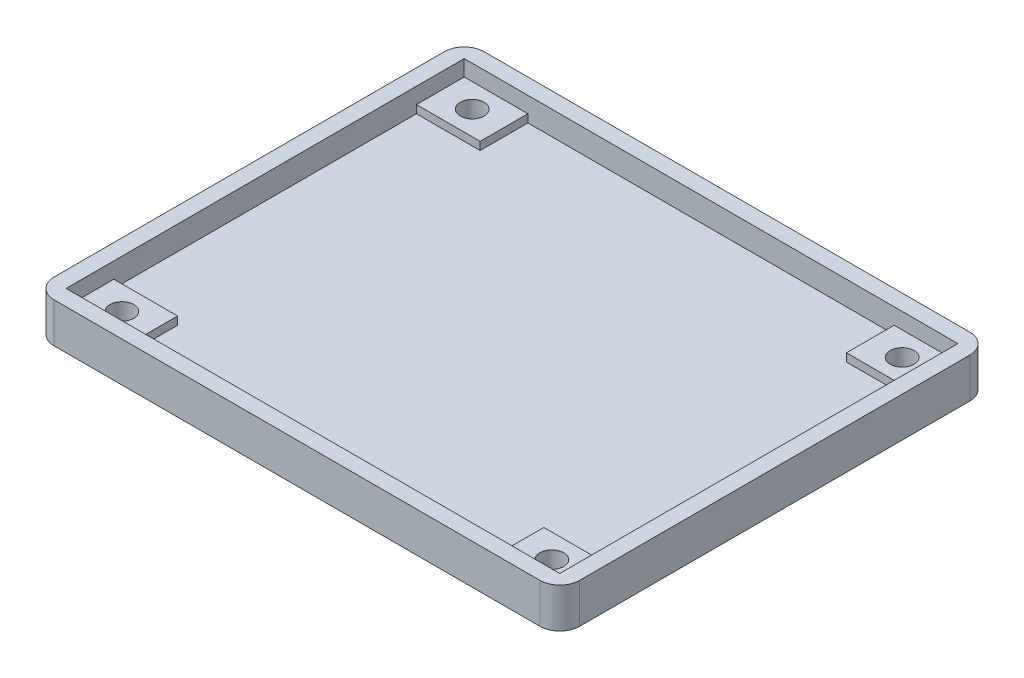
ISO-10303-21;
HEADER;
FILE_DESCRIPTION(('STEP AP214'),'2;1');
FILE_NAME('part.step','',(''),(''),'','','');
FILE_SCHEMA(('AUTOMOTIVE_DESIGN { 1 0 10303 214 1 1 1 1 }'));
ENDSEC;
DATA;
#1=APPLICATION_CONTEXT('core data for automotive mechanical design processes');
#2=APPLICATION_PROTOCOL_DEFINITION('international standard','automotive_design',2000,#1);
#3=PRODUCT_CONTEXT('',#1,'mechanical');
#4=PRODUCT('Part','Part','',(#3));
#5=PRODUCT_RELATED_PRODUCT_CATEGORY('part','',(#4));
#6=PRODUCT_DEFINITION_FORMATION('','',#4);
#7=PRODUCT_DEFINITION_CONTEXT('part definition',#1,'design');
#8=PRODUCT_DEFINITION('design','',#6,#7);
#9=PRODUCT_DEFINITION_SHAPE('','',#8);
#10=(LENGTH_UNIT() NAMED_UNIT(*) SI_UNIT(.MILLI.,.METRE.));
#11=(NAMED_UNIT(*) PLANE_ANGLE_UNIT() SI_UNIT($,.RADIAN.));
#12=(NAMED_UNIT(*) SI_UNIT($,.STERADIAN.) SOLID_ANGLE_UNIT());
#13=UNCERTAINTY_MEASURE_WITH_UNIT(LENGTH_MEASURE(1.E-05),#10,'distance_accuracy_value','');
#14=(GEOMETRIC_REPRESENTATION_CONTEXT(3) GLOBAL_UNCERTAINTY_ASSIGNED_CONTEXT((#13)) GLOBAL_UNIT_ASSIGNED_CONTEXT((#10,
#11,#12)) REPRESENTATION_CONTEXT('',''));
#15=CARTESIAN_POINT('',(0.,0.,0.));
#16=DIRECTION('',(0.,0.,1.));
#17=DIRECTION('',(1.,0.,0.));
#18=AXIS2_PLACEMENT_3D('',#15,#16,#17);
#19=CARTESIAN_POINT('',(31.,2.,25.));
#20=DIRECTION('',(1.,0.,0.));
#21=DIRECTION('',(0.,0.,-1.));
#22=AXIS2_PLACEMENT_3D('',#19,#20,#21);
#23=PLANE('',#22);
#24=DIRECTION('',(0.,1.,0.));
#25=VECTOR('',#24,1.);
#26=CARTESIAN_POINT('',(31.,2.,-25.));
#27=LINE('',#26,#25);
#28=CARTESIAN_POINT('',(31.,3.,-25.));
#29=VERTEX_POINT('',#28);
#30=CARTESIAN_POINT('',(31.,5.,-25.));
#31=VERTEX_POINT('',#30);
#32=EDGE_CURVE('E346',#29,#31,#27,.T.);
#33=ORIENTED_EDGE('',*,*,#32,.F.);
#34=DIRECTION('',(0.,0.,-1.));
#35=VECTOR('',#34,1.);
#36=CARTESIAN_POINT('',(31.,3.,-25.));
#37=LINE('',#36,#35);
#38=CARTESIAN_POINT('',(31.,3.,-19.));
#39=VERTEX_POINT('',#38);
#40=EDGE_CURVE('E229',#39,#29,#37,.T.);
#41=ORIENTED_EDGE('',*,*,#40,.F.);
#42=DIRECTION('',(0.,-1.,0.));
#43=VECTOR('',#42,1.);
#44=CARTESIAN_POINT('',(31.,3.,-19.));
#45=LINE('',#44,#43);
#46=CARTESIAN_POINT('',(31.,2.,-19.));
#47=VERTEX_POINT('',#46);
#48=EDGE_CURVE('E224',#39,#47,#45,.T.);
#49=ORIENTED_EDGE('',*,*,#48,.T.);
#50=DIRECTION('',(0.,0.,-1.));
#51=VECTOR('',#50,1.);
#52=CARTESIAN_POINT('',(31.,2.,25.));
#53=LINE('',#52,#51);
#54=CARTESIAN_POINT('',(31.,2.,19.));
#55=VERTEX_POINT('',#54);
#56=EDGE_CURVE('E333',#55,#47,#53,.T.);
#57=ORIENTED_EDGE('',*,*,#56,.F.);
#58=DIRECTION('',(0.,-1.,0.));
#59=VECTOR('',#58,1.);
#60=CARTESIAN_POINT('',(31.,3.,19.));
#61=LINE('',#60,#59);
#62=CARTESIAN_POINT('',(31.,3.,19.));
#63=VERTEX_POINT('',#62);
#64=EDGE_CURVE('E266',#63,#55,#61,.T.);
#65=ORIENTED_EDGE('',*,*,#64,.F.);
#66=DIRECTION('',(0.,0.,-1.));
#67=VECTOR('',#66,1.);
#68=CARTESIAN_POINT('',(31.,3.,25.));
#69=LINE('',#68,#67);
#70=CARTESIAN_POINT('',(31.,3.,25.));
#71=VERTEX_POINT('',#70);
#72=EDGE_CURVE('E247',#71,#63,#69,.T.);
#73=ORIENTED_EDGE('',*,*,#72,.F.);
#74=DIRECTION('',(0.,1.,0.));
#75=VECTOR('',#74,1.);
#76=CARTESIAN_POINT('',(31.,2.,25.));
#77=LINE('',#76,#75);
#78=CARTESIAN_POINT('',(31.,5.,25.));
#79=VERTEX_POINT('',#78);
#80=EDGE_CURVE('E361',#71,#79,#77,.T.);
#81=ORIENTED_EDGE('',*,*,#80,.T.);
#82=DIRECTION('',(0.,0.,-1.));
#83=VECTOR('',#82,1.);
#84=CARTESIAN_POINT('',(31.,5.,25.));
#85=LINE('',#84,#83);
#86=EDGE_CURVE('E332',#79,#31,#85,.T.);
#87=ORIENTED_EDGE('',*,*,#86,.T.);
#88=EDGE_LOOP('',(#33,#41,#49,#57,#65,#73,#81,#87));
#89=FACE_BOUND('',#88,.T.);
#90=ADVANCED_FACE('F39',(#89),#23,.F.);
#91=CARTESIAN_POINT('',(-31.,2.,25.));
#92=DIRECTION('',(0.,0.,1.));
#93=DIRECTION('',(1.,0.,0.));
#94=AXIS2_PLACEMENT_3D('',#91,#92,#93);
#95=PLANE('',#94);
#96=DIRECTION('',(1.,0.,0.));
#97=VECTOR('',#96,1.);
#98=CARTESIAN_POINT('',(31.,3.,25.));
#99=LINE('',#98,#97);
#100=CARTESIAN_POINT('',(23.,3.,25.));
#101=VERTEX_POINT('',#100);
#102=EDGE_CURVE('E243',#101,#71,#99,.T.);
#103=ORIENTED_EDGE('',*,*,#102,.F.);
#104=DIRECTION('',(0.,-1.,0.));
#105=VECTOR('',#104,1.);
#106=CARTESIAN_POINT('',(23.,3.,25.));
#107=LINE('',#106,#105);
#108=CARTESIAN_POINT('',(23.,2.,25.));
#109=VERTEX_POINT('',#108);
#110=EDGE_CURVE('E258',#101,#109,#107,.T.);
#111=ORIENTED_EDGE('',*,*,#110,.T.);
#112=DIRECTION('',(1.,0.,0.));
#113=VECTOR('',#112,1.);
#114=CARTESIAN_POINT('',(-31.,2.,25.));
#115=LINE('',#114,#113);
#116=CARTESIAN_POINT('',(-23.,2.,25.));
#117=VERTEX_POINT('',#116);
#118=EDGE_CURVE('E343',#117,#109,#115,.T.);
#119=ORIENTED_EDGE('',*,*,#118,.F.);
#120=DIRECTION('',(0.,-1.,0.));
#121=VECTOR('',#120,1.);
#122=CARTESIAN_POINT('',(-23.,3.,25.));
#123=LINE('',#122,#121);
#124=CARTESIAN_POINT('',(-23.,3.,25.));
#125=VERTEX_POINT('',#124);
#126=EDGE_CURVE('E297',#125,#117,#123,.T.);
#127=ORIENTED_EDGE('',*,*,#126,.F.);
#128=DIRECTION('',(1.,0.,0.));
#129=VECTOR('',#128,1.);
#130=CARTESIAN_POINT('',(-31.,3.,25.));
#131=LINE('',#130,#129);
#132=CARTESIAN_POINT('',(-31.,3.,25.));
#133=VERTEX_POINT('',#132);
#134=EDGE_CURVE('E274',#133,#125,#131,.T.);
#135=ORIENTED_EDGE('',*,*,#134,.F.);
#136=DIRECTION('',(0.,1.,0.));
#137=VECTOR('',#136,1.);
#138=CARTESIAN_POINT('',(-31.,2.,25.));
#139=LINE('',#138,#137);
#140=CARTESIAN_POINT('',(-31.,5.,25.));
#141=VERTEX_POINT('',#140);
#142=EDGE_CURVE('E365',#133,#141,#139,.T.);
#143=ORIENTED_EDGE('',*,*,#142,.T.);
#144=DIRECTION('',(1.,0.,0.));
#145=VECTOR('',#144,1.);
#146=CARTESIAN_POINT('',(-31.,5.,25.));
#147=LINE('',#146,#145);
#148=EDGE_CURVE('E337',#141,#79,#147,.T.);
#149=ORIENTED_EDGE('',*,*,#148,.T.);
#150=ORIENTED_EDGE('',*,*,#80,.F.);
#151=EDGE_LOOP('',(#103,#111,#119,#127,#135,#143,#149,#150));
#152=FACE_BOUND('',#151,.T.);
#153=ADVANCED_FACE('F531',(#152),#95,.F.);
#154=CARTESIAN_POINT('',(33.,5.,27.));
#155=DIRECTION('',(-1.,0.,0.));
#156=DIRECTION('',(0.,0.,1.));
#157=AXIS2_PLACEMENT_3D('',#154,#155,#156);
#158=PLANE('',#157);
#159=DIRECTION('',(0.,0.,-1.));
#160=VECTOR('',#159,1.);
#161=CARTESIAN_POINT('',(33.,5.,27.));
#162=LINE('',#161,#160);
#163=CARTESIAN_POINT('',(33.,5.,24.5));
#164=VERTEX_POINT('',#163);
#165=CARTESIAN_POINT('',(33.,5.,-24.5));
#166=VERTEX_POINT('',#165);
#167=EDGE_CURVE('E373',#164,#166,#162,.T.);
#168=ORIENTED_EDGE('',*,*,#167,.F.);
#169=DIRECTION('',(0.,-1.,0.));
#170=VECTOR('',#169,1.);
#171=CARTESIAN_POINT('',(33.,5.,24.5));
#172=LINE('',#171,#170);
#173=CARTESIAN_POINT('',(33.,0.,24.5));
#174=VERTEX_POINT('',#173);
#175=EDGE_CURVE('E450',#164,#174,#172,.T.);
#176=ORIENTED_EDGE('',*,*,#175,.T.);
#177=DIRECTION('',(0.,0.,-1.));
#178=VECTOR('',#177,1.);
#179=CARTESIAN_POINT('',(33.,0.,27.));
#180=LINE('',#179,#178);
#181=CARTESIAN_POINT('',(33.,0.,-24.5));
#182=VERTEX_POINT('',#181);
#183=EDGE_CURVE('E364',#174,#182,#180,.T.);
#184=ORIENTED_EDGE('',*,*,#183,.T.);
#185=DIRECTION('',(0.,-1.,0.));
#186=VECTOR('',#185,1.);
#187=CARTESIAN_POINT('',(33.,5.,-24.5));
#188=LINE('',#187,#186);
#189=EDGE_CURVE('E430',#182,#166,#188,.F.);
#190=ORIENTED_EDGE('',*,*,#189,.T.);
#191=EDGE_LOOP('',(#168,#176,#184,#190));
#192=FACE_BOUND('',#191,.T.);
#193=ADVANCED_FACE('F516',(#192),#158,.F.);
#194=CARTESIAN_POINT('',(-33.,5.,-27.));
#195=DIRECTION('',(0.,0.,1.));
#196=DIRECTION('',(1.,0.,0.));
#197=AXIS2_PLACEMENT_3D('',#194,#195,#196);
#198=PLANE('',#197);
#199=DIRECTION('',(-1.,0.,0.));
#200=VECTOR('',#199,1.);
#201=CARTESIAN_POINT('',(-33.,5.,-27.));
#202=LINE('',#201,#200);
#203=CARTESIAN_POINT('',(30.5,5.,-27.));
#204=VERTEX_POINT('',#203);
#205=CARTESIAN_POINT('',(-30.5,5.,-27.));
#206=VERTEX_POINT('',#205);
#207=EDGE_CURVE('E377',#204,#206,#202,.T.);
#208=ORIENTED_EDGE('',*,*,#207,.F.);
#209=DIRECTION('',(0.,-1.,0.));
#210=VECTOR('',#209,1.);
#211=CARTESIAN_POINT('',(30.5,5.,-27.));
#212=LINE('',#211,#210);
#213=CARTESIAN_POINT('',(30.5,0.,-27.));
#214=VERTEX_POINT('',#213);
#215=EDGE_CURVE('E487',#204,#214,#212,.T.);
#216=ORIENTED_EDGE('',*,*,#215,.T.);
#217=DIRECTION('',(-1.,0.,0.));
#218=VECTOR('',#217,1.);
#219=CARTESIAN_POINT('',(-33.,0.,-27.));
#220=LINE('',#219,#218);
#221=CARTESIAN_POINT('',(-30.5,0.,-27.));
#222=VERTEX_POINT('',#221);
#223=EDGE_CURVE('E392',#214,#222,#220,.T.);
#224=ORIENTED_EDGE('',*,*,#223,.T.);
#225=DIRECTION('',(0.,-1.,0.));
#226=VECTOR('',#225,1.);
#227=CARTESIAN_POINT('',(-30.5,5.,-27.));
#228=LINE('',#227,#226);
#229=EDGE_CURVE('E484',#222,#206,#228,.F.);
#230=ORIENTED_EDGE('',*,*,#229,.T.);
#231=EDGE_LOOP('',(#208,#216,#224,#230));
#232=FACE_BOUND('',#231,.T.);
#233=ADVANCED_FACE('F524',(#232),#198,.F.);
#234=CARTESIAN_POINT('',(-33.,5.,27.));
#235=DIRECTION('',(1.,0.,0.));
#236=DIRECTION('',(0.,0.,-1.));
#237=AXIS2_PLACEMENT_3D('',#234,#235,#236);
#238=PLANE('',#237);
#239=DIRECTION('',(0.,0.,1.));
#240=VECTOR('',#239,1.);
#241=CARTESIAN_POINT('',(-33.,0.,27.));
#242=LINE('',#241,#240);
#243=CARTESIAN_POINT('',(-33.,0.,-24.5));
#244=VERTEX_POINT('',#243);
#245=CARTESIAN_POINT('',(-33.,0.,24.5));
#246=VERTEX_POINT('',#245);
#247=EDGE_CURVE('E396',#244,#246,#242,.T.);
#248=ORIENTED_EDGE('',*,*,#247,.T.);
#249=DIRECTION('',(0.,-1.,0.));
#250=VECTOR('',#249,1.);
#251=CARTESIAN_POINT('',(-33.,5.,24.5));
#252=LINE('',#251,#250);
#253=CARTESIAN_POINT('',(-33.,5.,24.5));
#254=VERTEX_POINT('',#253);
#255=EDGE_CURVE('E11',#246,#254,#252,.F.);
#256=ORIENTED_EDGE('',*,*,#255,.T.);
#257=DIRECTION('',(0.,0.,1.));
#258=VECTOR('',#257,1.);
#259=CARTESIAN_POINT('',(-33.,5.,27.));
#260=LINE('',#259,#258);
#261=CARTESIAN_POINT('',(-33.,5.,-24.5));
#262=VERTEX_POINT('',#261);
#263=EDGE_CURVE('E381',#262,#254,#260,.T.);
#264=ORIENTED_EDGE('',*,*,#263,.F.);
#265=DIRECTION('',(0.,-1.,0.));
#266=VECTOR('',#265,1.);
#267=CARTESIAN_POINT('',(-33.,5.,-24.5));
#268=LINE('',#267,#266);
#269=EDGE_CURVE('E48',#262,#244,#268,.T.);
#270=ORIENTED_EDGE('',*,*,#269,.T.);
#271=EDGE_LOOP('',(#248,#256,#264,#270));
#272=FACE_BOUND('',#271,.T.);
#273=ADVANCED_FACE('F494',(#272),#238,.F.);
#274=CARTESIAN_POINT('',(-33.,5.,27.));
#275=DIRECTION('',(0.,0.,-1.));
#276=DIRECTION('',(-1.,0.,0.));
#277=AXIS2_PLACEMENT_3D('',#274,#275,#276);
#278=PLANE('',#277);
#279=DIRECTION('',(1.,0.,0.));
#280=VECTOR('',#279,1.);
#281=CARTESIAN_POINT('',(-33.,0.,27.));
#282=LINE('',#281,#280);
#283=CARTESIAN_POINT('',(-30.5,0.,27.));
#284=VERTEX_POINT('',#283);
#285=CARTESIAN_POINT('',(30.5,0.,27.));
#286=VERTEX_POINT('',#285);
#287=EDGE_CURVE('E378',#284,#286,#282,.T.);
#288=ORIENTED_EDGE('',*,*,#287,.T.);
#289=DIRECTION('',(0.,-1.,0.));
#290=VECTOR('',#289,1.);
#291=CARTESIAN_POINT('',(30.5,5.,27.));
#292=LINE('',#291,#290);
#293=CARTESIAN_POINT('',(30.5,5.,27.));
#294=VERTEX_POINT('',#293);
#295=EDGE_CURVE('E470',#286,#294,#292,.F.);
#296=ORIENTED_EDGE('',*,*,#295,.T.);
#297=DIRECTION('',(1.,0.,0.));
#298=VECTOR('',#297,1.);
#299=CARTESIAN_POINT('',(-33.,5.,27.));
#300=LINE('',#299,#298);
#301=CARTESIAN_POINT('',(-30.5,5.,27.));
#302=VERTEX_POINT('',#301);
#303=EDGE_CURVE('E384',#302,#294,#300,.T.);
#304=ORIENTED_EDGE('',*,*,#303,.F.);
#305=DIRECTION('',(0.,-1.,0.));
#306=VECTOR('',#305,1.);
#307=CARTESIAN_POINT('',(-30.5,5.,27.));
#308=LINE('',#307,#306);
#309=EDGE_CURVE('E466',#302,#284,#308,.T.);
#310=ORIENTED_EDGE('',*,*,#309,.T.);
#311=EDGE_LOOP('',(#288,#296,#304,#310));
#312=FACE_BOUND('',#311,.T.);
#313=ADVANCED_FACE('F507',(#312),#278,.F.);
#314=CARTESIAN_POINT('',(0.,5.,0.));
#315=DIRECTION('',(0.,-1.,0.));
#316=DIRECTION('',(0.,0.,-1.));
#317=AXIS2_PLACEMENT_3D('',#314,#315,#316);
#318=PLANE('',#317);
#319=DIRECTION('',(-1.,0.,0.));
#320=VECTOR('',#319,1.);
#321=CARTESIAN_POINT('',(-31.,5.,-25.));
#322=LINE('',#321,#320);
#323=CARTESIAN_POINT('',(-31.,5.,-25.));
#324=VERTEX_POINT('',#323);
#325=EDGE_CURVE('E350',#31,#324,#322,.T.);
#326=ORIENTED_EDGE('',*,*,#325,.F.);
#327=ORIENTED_EDGE('',*,*,#86,.F.);
#328=ORIENTED_EDGE('',*,*,#148,.F.);
#329=DIRECTION('',(0.,0.,1.));
#330=VECTOR('',#329,1.);
#331=CARTESIAN_POINT('',(-31.,5.,25.));
#332=LINE('',#331,#330);
#333=EDGE_CURVE('E354',#324,#141,#332,.T.);
#334=ORIENTED_EDGE('',*,*,#333,.F.);
#335=EDGE_LOOP('',(#326,#327,#328,#334));
#336=FACE_BOUND('',#335,.T.);
#337=ORIENTED_EDGE('',*,*,#303,.T.);
#338=CARTESIAN_POINT('',(30.5,5.,24.5));
#339=DIRECTION('',(0.,-1.,0.));
#340=DIRECTION('',(0.,0.,-1.));
#341=AXIS2_PLACEMENT_3D('',#338,#339,#340);
#342=CIRCLE('',#341,2.5);
#343=EDGE_CURVE('E481',#294,#164,#342,.F.);
#344=ORIENTED_EDGE('',*,*,#343,.T.);
#345=ORIENTED_EDGE('',*,*,#167,.T.);
#346=CARTESIAN_POINT('',(30.5,5.,-24.5));
#347=DIRECTION('',(0.,-1.,0.));
#348=DIRECTION('',(0.,0.,-1.));
#349=AXIS2_PLACEMENT_3D('',#346,#347,#348);
#350=CIRCLE('',#349,2.5);
#351=EDGE_CURVE('E478',#166,#204,#350,.F.);
#352=ORIENTED_EDGE('',*,*,#351,.T.);
#353=ORIENTED_EDGE('',*,*,#207,.T.);
#354=CARTESIAN_POINT('',(-30.5,5.,-24.5));
#355=DIRECTION('',(0.,-1.,0.));
#356=DIRECTION('',(0.,0.,-1.));
#357=AXIS2_PLACEMENT_3D('',#354,#355,#356);
#358=CIRCLE('',#357,2.5);
#359=EDGE_CURVE('E60',#206,#262,#358,.F.);
#360=ORIENTED_EDGE('',*,*,#359,.T.);
#361=ORIENTED_EDGE('',*,*,#263,.T.);
#362=CARTESIAN_POINT('',(-30.5,5.,24.5));
#363=DIRECTION('',(0.,-1.,0.));
#364=DIRECTION('',(0.,0.,-1.));
#365=AXIS2_PLACEMENT_3D('',#362,#363,#364);
#366=CIRCLE('',#365,2.5);
#367=EDGE_CURVE('E475',#254,#302,#366,.F.);
#368=ORIENTED_EDGE('',*,*,#367,.T.);
#369=EDGE_LOOP('',(#337,#344,#345,#352,#353,#360,#361,#368));
#370=FACE_BOUND('',#369,.T.);
#371=ADVANCED_FACE('F510',(#336,#370),#318,.F.);
#372=CARTESIAN_POINT('',(0.,0.,0.));
#373=DIRECTION('',(0.,-1.,0.));
#374=DIRECTION('',(0.,0.,-1.));
#375=AXIS2_PLACEMENT_3D('',#372,#373,#374);
#376=PLANE('',#375);
#377=CARTESIAN_POINT('',(27.,0.,-22.));
#378=DIRECTION('',(0.,-1.,0.));
#379=DIRECTION('',(0.,0.,-1.));
#380=AXIS2_PLACEMENT_3D('',#377,#378,#379);
#381=CIRCLE('',#380,1.5);
#382=CARTESIAN_POINT('',(27.,0.,-23.5));
#383=VERTEX_POINT('',#382);
#384=EDGE_CURVE('E443',#383,#383,#381,.T.);
#385=ORIENTED_EDGE('',*,*,#384,.F.);
#386=EDGE_LOOP('',(#385));
#387=FACE_BOUND('',#386,.T.);
#388=CARTESIAN_POINT('',(27.,0.,22.));
#389=DIRECTION('',(0.,-1.,0.));
#390=DIRECTION('',(0.,0.,-1.));
#391=AXIS2_PLACEMENT_3D('',#388,#389,#390);
#392=CIRCLE('',#391,1.5);
#393=CARTESIAN_POINT('',(27.,0.,20.5));
#394=VERTEX_POINT('',#393);
#395=EDGE_CURVE('E439',#394,#394,#392,.T.);
#396=ORIENTED_EDGE('',*,*,#395,.F.);
#397=EDGE_LOOP('',(#396));
#398=FACE_BOUND('',#397,.T.);
#399=CARTESIAN_POINT('',(-27.,0.,22.));
#400=DIRECTION('',(0.,-1.,0.));
#401=DIRECTION('',(0.,0.,-1.));
#402=AXIS2_PLACEMENT_3D('',#399,#400,#401);
#403=CIRCLE('',#402,1.5);
#404=CARTESIAN_POINT('',(-27.,0.,20.5));
#405=VERTEX_POINT('',#404);
#406=EDGE_CURVE('E435',#405,#405,#403,.T.);
#407=ORIENTED_EDGE('',*,*,#406,.F.);
#408=EDGE_LOOP('',(#407));
#409=FACE_BOUND('',#408,.T.);
#410=CARTESIAN_POINT('',(-27.,0.,-22.));
#411=DIRECTION('',(0.,-1.,0.));
#412=DIRECTION('',(0.,0.,-1.));
#413=AXIS2_PLACEMENT_3D('',#410,#411,#412);
#414=CIRCLE('',#413,1.5);
#415=CARTESIAN_POINT('',(-27.,0.,-23.5));
#416=VERTEX_POINT('',#415);
#417=EDGE_CURVE('E431',#416,#416,#414,.T.);
#418=ORIENTED_EDGE('',*,*,#417,.F.);
#419=EDGE_LOOP('',(#418));
#420=FACE_BOUND('',#419,.T.);
#421=ORIENTED_EDGE('',*,*,#183,.F.);
#422=CARTESIAN_POINT('',(30.5,0.,24.5));
#423=DIRECTION('',(0.,-1.,0.));
#424=DIRECTION('',(0.,0.,-1.));
#425=AXIS2_PLACEMENT_3D('',#422,#423,#424);
#426=CIRCLE('',#425,2.5);
#427=EDGE_CURVE('E463',#174,#286,#426,.T.);
#428=ORIENTED_EDGE('',*,*,#427,.T.);
#429=ORIENTED_EDGE('',*,*,#287,.F.);
#430=CARTESIAN_POINT('',(-30.5,0.,24.5));
#431=DIRECTION('',(0.,-1.,0.));
#432=DIRECTION('',(0.,0.,-1.));
#433=AXIS2_PLACEMENT_3D('',#430,#431,#432);
#434=CIRCLE('',#433,2.5);
#435=EDGE_CURVE('E457',#284,#246,#434,.T.);
#436=ORIENTED_EDGE('',*,*,#435,.T.);
#437=ORIENTED_EDGE('',*,*,#247,.F.);
#438=CARTESIAN_POINT('',(-30.5,0.,-24.5));
#439=DIRECTION('',(0.,-1.,0.));
#440=DIRECTION('',(0.,0.,-1.));
#441=AXIS2_PLACEMENT_3D('',#438,#439,#440);
#442=CIRCLE('',#441,2.5);
#443=EDGE_CURVE('E454',#244,#222,#442,.T.);
#444=ORIENTED_EDGE('',*,*,#443,.T.);
#445=ORIENTED_EDGE('',*,*,#223,.F.);
#446=CARTESIAN_POINT('',(30.5,0.,-24.5));
#447=DIRECTION('',(0.,-1.,0.));
#448=DIRECTION('',(0.,0.,-1.));
#449=AXIS2_PLACEMENT_3D('',#446,#447,#448);
#450=CIRCLE('',#449,2.5);
#451=EDGE_CURVE('E460',#214,#182,#450,.T.);
#452=ORIENTED_EDGE('',*,*,#451,.T.);
#453=EDGE_LOOP('',(#421,#428,#429,#436,#437,#444,#445,#452));
#454=FACE_BOUND('',#453,.T.);
#455=ADVANCED_FACE('F498',(#387,#398,#409,#420,#454),#376,.T.);
#456=CARTESIAN_POINT('',(-31.,2.,25.));
#457=DIRECTION('',(-1.,0.,0.));
#458=DIRECTION('',(0.,0.,1.));
#459=AXIS2_PLACEMENT_3D('',#456,#457,#458);
#460=PLANE('',#459);
#461=ORIENTED_EDGE('',*,*,#142,.F.);
#462=DIRECTION('',(0.,0.,1.));
#463=VECTOR('',#462,1.);
#464=CARTESIAN_POINT('',(-31.,3.,25.));
#465=LINE('',#464,#463);
#466=CARTESIAN_POINT('',(-31.,3.,19.));
#467=VERTEX_POINT('',#466);
#468=EDGE_CURVE('E285',#467,#133,#465,.T.);
#469=ORIENTED_EDGE('',*,*,#468,.F.);
#470=DIRECTION('',(0.,-1.,0.));
#471=VECTOR('',#470,1.);
#472=CARTESIAN_POINT('',(-31.,3.,19.));
#473=LINE('',#472,#471);
#474=CARTESIAN_POINT('',(-31.,2.,19.));
#475=VERTEX_POINT('',#474);
#476=EDGE_CURVE('E289',#467,#475,#473,.T.);
#477=ORIENTED_EDGE('',*,*,#476,.T.);
#478=DIRECTION('',(0.,0.,1.));
#479=VECTOR('',#478,1.);
#480=CARTESIAN_POINT('',(-31.,2.,25.));
#481=LINE('',#480,#479);
#482=CARTESIAN_POINT('',(-31.,2.,-19.));
#483=VERTEX_POINT('',#482);
#484=EDGE_CURVE('E340',#483,#475,#481,.T.);
#485=ORIENTED_EDGE('',*,*,#484,.F.);
#486=DIRECTION('',(0.,-1.,0.));
#487=VECTOR('',#486,1.);
#488=CARTESIAN_POINT('',(-31.,3.,-19.));
#489=LINE('',#488,#487);
#490=CARTESIAN_POINT('',(-31.,3.,-19.));
#491=VERTEX_POINT('',#490);
#492=EDGE_CURVE('E328',#491,#483,#489,.T.);
#493=ORIENTED_EDGE('',*,*,#492,.F.);
#494=DIRECTION('',(0.,0.,1.));
#495=VECTOR('',#494,1.);
#496=CARTESIAN_POINT('',(-31.,3.,-25.));
#497=LINE('',#496,#495);
#498=CARTESIAN_POINT('',(-31.,3.,-25.));
#499=VERTEX_POINT('',#498);
#500=EDGE_CURVE('E305',#499,#491,#497,.T.);
#501=ORIENTED_EDGE('',*,*,#500,.F.);
#502=DIRECTION('',(0.,1.,0.));
#503=VECTOR('',#502,1.);
#504=CARTESIAN_POINT('',(-31.,2.,-25.));
#505=LINE('',#504,#503);
#506=EDGE_CURVE('E368',#499,#324,#505,.T.);
#507=ORIENTED_EDGE('',*,*,#506,.T.);
#508=ORIENTED_EDGE('',*,*,#333,.T.);
#509=EDGE_LOOP('',(#461,#469,#477,#485,#493,#501,#507,#508));
#510=FACE_BOUND('',#509,.T.);
#511=ADVANCED_FACE('F549',(#510),#460,.F.);
#512=CARTESIAN_POINT('',(-31.,2.,-25.));
#513=DIRECTION('',(0.,0.,-1.));
#514=DIRECTION('',(-1.,0.,0.));
#515=AXIS2_PLACEMENT_3D('',#512,#513,#514);
#516=PLANE('',#515);
#517=DIRECTION('',(0.,-1.,0.));
#518=VECTOR('',#517,1.);
#519=CARTESIAN_POINT('',(23.,3.,-25.));
#520=LINE('',#519,#518);
#521=CARTESIAN_POINT('',(23.,3.,-25.));
#522=VERTEX_POINT('',#521);
#523=CARTESIAN_POINT('',(23.,2.,-25.));
#524=VERTEX_POINT('',#523);
#525=EDGE_CURVE('E223',#522,#524,#520,.T.);
#526=ORIENTED_EDGE('',*,*,#525,.F.);
#527=DIRECTION('',(-1.,0.,0.));
#528=VECTOR('',#527,1.);
#529=CARTESIAN_POINT('',(31.,3.,-25.));
#530=LINE('',#529,#528);
#531=EDGE_CURVE('E210',#29,#522,#530,.T.);
#532=ORIENTED_EDGE('',*,*,#531,.F.);
#533=ORIENTED_EDGE('',*,*,#32,.T.);
#534=ORIENTED_EDGE('',*,*,#325,.T.);
#535=ORIENTED_EDGE('',*,*,#506,.F.);
#536=DIRECTION('',(-1.,0.,0.));
#537=VECTOR('',#536,1.);
#538=CARTESIAN_POINT('',(-31.,3.,-25.));
#539=LINE('',#538,#537);
#540=CARTESIAN_POINT('',(-23.,3.,-25.));
#541=VERTEX_POINT('',#540);
#542=EDGE_CURVE('E316',#541,#499,#539,.T.);
#543=ORIENTED_EDGE('',*,*,#542,.F.);
#544=DIRECTION('',(0.,-1.,0.));
#545=VECTOR('',#544,1.);
#546=CARTESIAN_POINT('',(-23.,3.,-25.));
#547=LINE('',#546,#545);
#548=CARTESIAN_POINT('',(-23.,2.,-25.));
#549=VERTEX_POINT('',#548);
#550=EDGE_CURVE('E320',#541,#549,#547,.T.);
#551=ORIENTED_EDGE('',*,*,#550,.T.);
#552=DIRECTION('',(-1.,0.,0.));
#553=VECTOR('',#552,1.);
#554=CARTESIAN_POINT('',(-31.,2.,-25.));
#555=LINE('',#554,#553);
#556=EDGE_CURVE('E336',#524,#549,#555,.T.);
#557=ORIENTED_EDGE('',*,*,#556,.F.);
#558=EDGE_LOOP('',(#526,#532,#533,#534,#535,#543,#551,#557));
#559=FACE_BOUND('',#558,.T.);
#560=ADVANCED_FACE('F542',(#559),#516,.F.);
#561=CARTESIAN_POINT('',(0.,2.,0.));
#562=DIRECTION('',(0.,-1.,0.));
#563=DIRECTION('',(0.,0.,-1.));
#564=AXIS2_PLACEMENT_3D('',#561,#562,#563);
#565=PLANE('',#564);
#566=DIRECTION('',(0.,0.,1.));
#567=VECTOR('',#566,1.);
#568=CARTESIAN_POINT('',(23.,2.,0.));
#569=LINE('',#568,#567);
#570=CARTESIAN_POINT('',(23.,2.,-19.));
#571=VERTEX_POINT('',#570);
#572=EDGE_CURVE('E219',#524,#571,#569,.T.);
#573=ORIENTED_EDGE('',*,*,#572,.F.);
#574=ORIENTED_EDGE('',*,*,#556,.T.);
#575=DIRECTION('',(0.,0.,-1.));
#576=VECTOR('',#575,1.);
#577=CARTESIAN_POINT('',(-23.,2.,0.));
#578=LINE('',#577,#576);
#579=CARTESIAN_POINT('',(-23.,2.,-19.));
#580=VERTEX_POINT('',#579);
#581=EDGE_CURVE('E388',#580,#549,#578,.T.);
#582=ORIENTED_EDGE('',*,*,#581,.F.);
#583=DIRECTION('',(1.,0.,0.));
#584=VECTOR('',#583,1.);
#585=CARTESIAN_POINT('',(0.,2.,-19.));
#586=LINE('',#585,#584);
#587=EDGE_CURVE('E405',#483,#580,#586,.T.);
#588=ORIENTED_EDGE('',*,*,#587,.F.);
#589=ORIENTED_EDGE('',*,*,#484,.T.);
#590=DIRECTION('',(-1.,0.,0.));
#591=VECTOR('',#590,1.);
#592=CARTESIAN_POINT('',(0.,2.,19.));
#593=LINE('',#592,#591);
#594=CARTESIAN_POINT('',(-23.,2.,19.));
#595=VERTEX_POINT('',#594);
#596=EDGE_CURVE('E409',#595,#475,#593,.T.);
#597=ORIENTED_EDGE('',*,*,#596,.F.);
#598=DIRECTION('',(0.,0.,-1.));
#599=VECTOR('',#598,1.);
#600=CARTESIAN_POINT('',(-23.,2.,0.));
#601=LINE('',#600,#599);
#602=EDGE_CURVE('E413',#117,#595,#601,.T.);
#603=ORIENTED_EDGE('',*,*,#602,.F.);
#604=ORIENTED_EDGE('',*,*,#118,.T.);
#605=DIRECTION('',(0.,0.,1.));
#606=VECTOR('',#605,1.);
#607=CARTESIAN_POINT('',(23.,2.,0.));
#608=LINE('',#607,#606);
#609=CARTESIAN_POINT('',(23.,2.,19.));
#610=VERTEX_POINT('',#609);
#611=EDGE_CURVE('E417',#610,#109,#608,.T.);
#612=ORIENTED_EDGE('',*,*,#611,.F.);
#613=DIRECTION('',(-1.,0.,0.));
#614=VECTOR('',#613,1.);
#615=CARTESIAN_POINT('',(0.,2.,19.));
#616=LINE('',#615,#614);
#617=EDGE_CURVE('E421',#55,#610,#616,.T.);
#618=ORIENTED_EDGE('',*,*,#617,.F.);
#619=ORIENTED_EDGE('',*,*,#56,.T.);
#620=DIRECTION('',(1.,0.,0.));
#621=VECTOR('',#620,1.);
#622=CARTESIAN_POINT('',(0.,2.,-19.));
#623=LINE('',#622,#621);
#624=EDGE_CURVE('E425',#571,#47,#623,.T.);
#625=ORIENTED_EDGE('',*,*,#624,.F.);
#626=EDGE_LOOP('',(#573,#574,#582,#588,#589,#597,#603,#604,#612,#618,#619,#625));
#627=FACE_BOUND('',#626,.T.);
#628=ADVANCED_FACE('F744',(#627),#565,.F.);
#629=CARTESIAN_POINT('',(-31.,3.,-19.));
#630=DIRECTION('',(0.,0.,-1.));
#631=DIRECTION('',(-1.,0.,0.));
#632=AXIS2_PLACEMENT_3D('',#629,#630,#631);
#633=PLANE('',#632);
#634=ORIENTED_EDGE('',*,*,#492,.T.);
#635=ORIENTED_EDGE('',*,*,#587,.T.);
#636=DIRECTION('',(0.,-1.,0.));
#637=VECTOR('',#636,1.);
#638=CARTESIAN_POINT('',(-23.,3.,-19.));
#639=LINE('',#638,#637);
#640=CARTESIAN_POINT('',(-23.,3.,-19.));
#641=VERTEX_POINT('',#640);
#642=EDGE_CURVE('E324',#641,#580,#639,.T.);
#643=ORIENTED_EDGE('',*,*,#642,.F.);
#644=DIRECTION('',(1.,0.,0.));
#645=VECTOR('',#644,1.);
#646=CARTESIAN_POINT('',(-31.,3.,-19.));
#647=LINE('',#646,#645);
#648=EDGE_CURVE('E309',#491,#641,#647,.T.);
#649=ORIENTED_EDGE('',*,*,#648,.F.);
#650=EDGE_LOOP('',(#634,#635,#643,#649));
#651=FACE_BOUND('',#650,.T.);
#652=ADVANCED_FACE('F734',(#651),#633,.F.);
#653=CARTESIAN_POINT('',(-23.,3.,-25.));
#654=DIRECTION('',(-1.,0.,0.));
#655=DIRECTION('',(0.,0.,1.));
#656=AXIS2_PLACEMENT_3D('',#653,#654,#655);
#657=PLANE('',#656);
#658=ORIENTED_EDGE('',*,*,#642,.T.);
#659=ORIENTED_EDGE('',*,*,#581,.T.);
#660=ORIENTED_EDGE('',*,*,#550,.F.);
#661=DIRECTION('',(0.,0.,-1.));
#662=VECTOR('',#661,1.);
#663=CARTESIAN_POINT('',(-23.,3.,-25.));
#664=LINE('',#663,#662);
#665=EDGE_CURVE('E312',#641,#541,#664,.T.);
#666=ORIENTED_EDGE('',*,*,#665,.F.);
#667=EDGE_LOOP('',(#658,#659,#660,#666));
#668=FACE_BOUND('',#667,.T.);
#669=ADVANCED_FACE('F641',(#668),#657,.F.);
#670=CARTESIAN_POINT('',(-27.,3.,-22.));
#671=DIRECTION('',(0.,-1.,0.));
#672=DIRECTION('',(0.,0.,-1.));
#673=AXIS2_PLACEMENT_3D('',#670,#671,#672);
#674=CYLINDRICAL_SURFACE('',#673,1.5);
#675=CARTESIAN_POINT('',(-27.,3.,-22.));
#676=DIRECTION('',(0.,1.,0.));
#677=DIRECTION('',(0.,0.,1.));
#678=AXIS2_PLACEMENT_3D('',#675,#676,#677);
#679=CIRCLE('',#678,1.5);
#680=CARTESIAN_POINT('',(-27.,3.,-20.5));
#681=VERTEX_POINT('',#680);
#682=EDGE_CURVE('E301',#681,#681,#679,.T.);
#683=ORIENTED_EDGE('',*,*,#682,.T.);
#684=EDGE_LOOP('',(#683));
#685=FACE_BOUND('',#684,.T.);
#686=ORIENTED_EDGE('',*,*,#417,.T.);
#687=EDGE_LOOP('',(#686));
#688=FACE_BOUND('',#687,.T.);
#689=ADVANCED_FACE('F635',(#685,#688),#674,.F.);
#690=CARTESIAN_POINT('',(0.,3.,0.));
#691=DIRECTION('',(0.,1.,0.));
#692=DIRECTION('',(0.,0.,1.));
#693=AXIS2_PLACEMENT_3D('',#690,#691,#692);
#694=PLANE('',#693);
#695=ORIENTED_EDGE('',*,*,#500,.T.);
#696=ORIENTED_EDGE('',*,*,#648,.T.);
#697=ORIENTED_EDGE('',*,*,#665,.T.);
#698=ORIENTED_EDGE('',*,*,#542,.T.);
#699=EDGE_LOOP('',(#695,#696,#697,#698));
#700=FACE_BOUND('',#699,.T.);
#701=ORIENTED_EDGE('',*,*,#682,.F.);
#702=EDGE_LOOP('',(#701));
#703=FACE_BOUND('',#702,.T.);
#704=ADVANCED_FACE('F640',(#700,#703),#694,.T.);
#705=CARTESIAN_POINT('',(-23.,3.,25.));
#706=DIRECTION('',(-1.,0.,0.));
#707=DIRECTION('',(0.,0.,1.));
#708=AXIS2_PLACEMENT_3D('',#705,#706,#707);
#709=PLANE('',#708);
#710=ORIENTED_EDGE('',*,*,#126,.T.);
#711=ORIENTED_EDGE('',*,*,#602,.T.);
#712=DIRECTION('',(0.,-1.,0.));
#713=VECTOR('',#712,1.);
#714=CARTESIAN_POINT('',(-23.,3.,19.));
#715=LINE('',#714,#713);
#716=CARTESIAN_POINT('',(-23.,3.,19.));
#717=VERTEX_POINT('',#716);
#718=EDGE_CURVE('E293',#717,#595,#715,.T.);
#719=ORIENTED_EDGE('',*,*,#718,.F.);
#720=DIRECTION('',(0.,0.,-1.));
#721=VECTOR('',#720,1.);
#722=CARTESIAN_POINT('',(-23.,3.,25.));
#723=LINE('',#722,#721);
#724=EDGE_CURVE('E278',#125,#717,#723,.T.);
#725=ORIENTED_EDGE('',*,*,#724,.F.);
#726=EDGE_LOOP('',(#710,#711,#719,#725));
#727=FACE_BOUND('',#726,.T.);
#728=ADVANCED_FACE('F708',(#727),#709,.F.);
#729=CARTESIAN_POINT('',(-31.,3.,19.));
#730=DIRECTION('',(0.,0.,1.));
#731=DIRECTION('',(1.,0.,0.));
#732=AXIS2_PLACEMENT_3D('',#729,#730,#731);
#733=PLANE('',#732);
#734=ORIENTED_EDGE('',*,*,#718,.T.);
#735=ORIENTED_EDGE('',*,*,#596,.T.);
#736=ORIENTED_EDGE('',*,*,#476,.F.);
#737=DIRECTION('',(-1.,0.,0.));
#738=VECTOR('',#737,1.);
#739=CARTESIAN_POINT('',(-31.,3.,19.));
#740=LINE('',#739,#738);
#741=EDGE_CURVE('E281',#717,#467,#740,.T.);
#742=ORIENTED_EDGE('',*,*,#741,.F.);
#743=EDGE_LOOP('',(#734,#735,#736,#742));
#744=FACE_BOUND('',#743,.T.);
#745=ADVANCED_FACE('F626',(#744),#733,.F.);
#746=CARTESIAN_POINT('',(-27.,3.,22.));
#747=DIRECTION('',(0.,-1.,0.));
#748=DIRECTION('',(0.,0.,-1.));
#749=AXIS2_PLACEMENT_3D('',#746,#747,#748);
#750=CYLINDRICAL_SURFACE('',#749,1.5);
#751=CARTESIAN_POINT('',(-27.,3.,22.));
#752=DIRECTION('',(0.,1.,0.));
#753=DIRECTION('',(0.,0.,-1.));
#754=AXIS2_PLACEMENT_3D('',#751,#752,#753);
#755=CIRCLE('',#754,1.5);
#756=CARTESIAN_POINT('',(-27.,3.,20.5));
#757=VERTEX_POINT('',#756);
#758=EDGE_CURVE('E270',#757,#757,#755,.T.);
#759=ORIENTED_EDGE('',*,*,#758,.T.);
#760=EDGE_LOOP('',(#759));
#761=FACE_BOUND('',#760,.T.);
#762=ORIENTED_EDGE('',*,*,#406,.T.);
#763=EDGE_LOOP('',(#762));
#764=FACE_BOUND('',#763,.T.);
#765=ADVANCED_FACE('F619',(#761,#764),#750,.F.);
#766=CARTESIAN_POINT('',(0.,3.,0.));
#767=DIRECTION('',(0.,1.,0.));
#768=DIRECTION('',(0.,0.,1.));
#769=AXIS2_PLACEMENT_3D('',#766,#767,#768);
#770=PLANE('',#769);
#771=ORIENTED_EDGE('',*,*,#134,.T.);
#772=ORIENTED_EDGE('',*,*,#724,.T.);
#773=ORIENTED_EDGE('',*,*,#741,.T.);
#774=ORIENTED_EDGE('',*,*,#468,.T.);
#775=EDGE_LOOP('',(#771,#772,#773,#774));
#776=FACE_BOUND('',#775,.T.);
#777=ORIENTED_EDGE('',*,*,#758,.F.);
#778=EDGE_LOOP('',(#777));
#779=FACE_BOUND('',#778,.T.);
#780=ADVANCED_FACE('F625',(#776,#779),#770,.T.);
#781=CARTESIAN_POINT('',(31.,3.,19.));
#782=DIRECTION('',(0.,0.,1.));
#783=DIRECTION('',(1.,0.,0.));
#784=AXIS2_PLACEMENT_3D('',#781,#782,#783);
#785=PLANE('',#784);
#786=ORIENTED_EDGE('',*,*,#64,.T.);
#787=ORIENTED_EDGE('',*,*,#617,.T.);
#788=DIRECTION('',(0.,-1.,0.));
#789=VECTOR('',#788,1.);
#790=CARTESIAN_POINT('',(23.,3.,19.));
#791=LINE('',#790,#789);
#792=CARTESIAN_POINT('',(23.,3.,19.));
#793=VERTEX_POINT('',#792);
#794=EDGE_CURVE('E262',#793,#610,#791,.T.);
#795=ORIENTED_EDGE('',*,*,#794,.F.);
#796=DIRECTION('',(-1.,0.,0.));
#797=VECTOR('',#796,1.);
#798=CARTESIAN_POINT('',(31.,3.,19.));
#799=LINE('',#798,#797);
#800=EDGE_CURVE('E251',#63,#793,#799,.T.);
#801=ORIENTED_EDGE('',*,*,#800,.F.);
#802=EDGE_LOOP('',(#786,#787,#795,#801));
#803=FACE_BOUND('',#802,.T.);
#804=ADVANCED_FACE('F682',(#803),#785,.F.);
#805=CARTESIAN_POINT('',(23.,3.,25.));
#806=DIRECTION('',(1.,0.,0.));
#807=DIRECTION('',(0.,0.,-1.));
#808=AXIS2_PLACEMENT_3D('',#805,#806,#807);
#809=PLANE('',#808);
#810=ORIENTED_EDGE('',*,*,#794,.T.);
#811=ORIENTED_EDGE('',*,*,#611,.T.);
#812=ORIENTED_EDGE('',*,*,#110,.F.);
#813=DIRECTION('',(0.,0.,1.));
#814=VECTOR('',#813,1.);
#815=CARTESIAN_POINT('',(23.,3.,25.));
#816=LINE('',#815,#814);
#817=EDGE_CURVE('E254',#793,#101,#816,.T.);
#818=ORIENTED_EDGE('',*,*,#817,.F.);
#819=EDGE_LOOP('',(#810,#811,#812,#818));
#820=FACE_BOUND('',#819,.T.);
#821=ADVANCED_FACE('F610',(#820),#809,.F.);
#822=CARTESIAN_POINT('',(27.,3.,22.));
#823=DIRECTION('',(0.,-1.,0.));
#824=DIRECTION('',(0.,0.,-1.));
#825=AXIS2_PLACEMENT_3D('',#822,#823,#824);
#826=CYLINDRICAL_SURFACE('',#825,1.5);
#827=CARTESIAN_POINT('',(27.,3.,22.));
#828=DIRECTION('',(0.,1.,0.));
#829=DIRECTION('',(0.,0.,1.));
#830=AXIS2_PLACEMENT_3D('',#827,#828,#829);
#831=CIRCLE('',#830,1.5);
#832=CARTESIAN_POINT('',(27.,3.,23.5));
#833=VERTEX_POINT('',#832);
#834=EDGE_CURVE('E239',#833,#833,#831,.T.);
#835=ORIENTED_EDGE('',*,*,#834,.T.);
#836=EDGE_LOOP('',(#835));
#837=FACE_BOUND('',#836,.T.);
#838=ORIENTED_EDGE('',*,*,#395,.T.);
#839=EDGE_LOOP('',(#838));
#840=FACE_BOUND('',#839,.T.);
#841=ADVANCED_FACE('F603',(#837,#840),#826,.F.);
#842=CARTESIAN_POINT('',(0.,3.,0.));
#843=DIRECTION('',(0.,-1.,0.));
#844=DIRECTION('',(0.,0.,-1.));
#845=AXIS2_PLACEMENT_3D('',#842,#843,#844);
#846=PLANE('',#845);
#847=ORIENTED_EDGE('',*,*,#102,.T.);
#848=ORIENTED_EDGE('',*,*,#72,.T.);
#849=ORIENTED_EDGE('',*,*,#800,.T.);
#850=ORIENTED_EDGE('',*,*,#817,.T.);
#851=EDGE_LOOP('',(#847,#848,#849,#850));
#852=FACE_BOUND('',#851,.T.);
#853=ORIENTED_EDGE('',*,*,#834,.F.);
#854=EDGE_LOOP('',(#853));
#855=FACE_BOUND('',#854,.T.);
#856=ADVANCED_FACE('F609',(#852,#855),#846,.F.);
#857=CARTESIAN_POINT('',(23.,3.,-25.));
#858=DIRECTION('',(1.,0.,0.));
#859=DIRECTION('',(0.,0.,-1.));
#860=AXIS2_PLACEMENT_3D('',#857,#858,#859);
#861=PLANE('',#860);
#862=ORIENTED_EDGE('',*,*,#525,.T.);
#863=ORIENTED_EDGE('',*,*,#572,.T.);
#864=DIRECTION('',(0.,-1.,0.));
#865=VECTOR('',#864,1.);
#866=CARTESIAN_POINT('',(23.,3.,-19.));
#867=LINE('',#866,#865);
#868=CARTESIAN_POINT('',(23.,3.,-19.));
#869=VERTEX_POINT('',#868);
#870=EDGE_CURVE('E217',#869,#571,#867,.T.);
#871=ORIENTED_EDGE('',*,*,#870,.F.);
#872=DIRECTION('',(0.,0.,1.));
#873=VECTOR('',#872,1.);
#874=CARTESIAN_POINT('',(23.,3.,-25.));
#875=LINE('',#874,#873);
#876=EDGE_CURVE('E202',#522,#869,#875,.T.);
#877=ORIENTED_EDGE('',*,*,#876,.F.);
#878=EDGE_LOOP('',(#862,#863,#871,#877));
#879=FACE_BOUND('',#878,.T.);
#880=ADVANCED_FACE('F218',(#879),#861,.F.);
#881=CARTESIAN_POINT('',(31.,3.,-19.));
#882=DIRECTION('',(0.,0.,-1.));
#883=DIRECTION('',(-1.,0.,0.));
#884=AXIS2_PLACEMENT_3D('',#881,#882,#883);
#885=PLANE('',#884);
#886=ORIENTED_EDGE('',*,*,#870,.T.);
#887=ORIENTED_EDGE('',*,*,#624,.T.);
#888=ORIENTED_EDGE('',*,*,#48,.F.);
#889=DIRECTION('',(1.,0.,0.));
#890=VECTOR('',#889,1.);
#891=CARTESIAN_POINT('',(31.,3.,-19.));
#892=LINE('',#891,#890);
#893=EDGE_CURVE('E208',#869,#39,#892,.T.);
#894=ORIENTED_EDGE('',*,*,#893,.F.);
#895=EDGE_LOOP('',(#886,#887,#888,#894));
#896=FACE_BOUND('',#895,.T.);
#897=ADVANCED_FACE('F226',(#896),#885,.F.);
#898=CARTESIAN_POINT('',(27.,3.,-22.));
#899=DIRECTION('',(0.,-1.,0.));
#900=DIRECTION('',(0.,0.,-1.));
#901=AXIS2_PLACEMENT_3D('',#898,#899,#900);
#902=CYLINDRICAL_SURFACE('',#901,1.5);
#903=CARTESIAN_POINT('',(27.,3.,-22.));
#904=DIRECTION('',(0.,1.,0.));
#905=DIRECTION('',(0.,0.,-1.));
#906=AXIS2_PLACEMENT_3D('',#903,#904,#905);
#907=CIRCLE('',#906,1.5);
#908=CARTESIAN_POINT('',(27.,3.,-23.5));
#909=VERTEX_POINT('',#908);
#910=EDGE_CURVE('E447',#909,#909,#907,.T.);
#911=ORIENTED_EDGE('',*,*,#910,.T.);
#912=EDGE_LOOP('',(#911));
#913=FACE_BOUND('',#912,.T.);
#914=ORIENTED_EDGE('',*,*,#384,.T.);
#915=EDGE_LOOP('',(#914));
#916=FACE_BOUND('',#915,.T.);
#917=ADVANCED_FACE('F587',(#913,#916),#902,.F.);
#918=CARTESIAN_POINT('',(0.,3.,0.));
#919=DIRECTION('',(0.,1.,0.));
#920=DIRECTION('',(0.,0.,1.));
#921=AXIS2_PLACEMENT_3D('',#918,#919,#920);
#922=PLANE('',#921);
#923=ORIENTED_EDGE('',*,*,#531,.T.);
#924=ORIENTED_EDGE('',*,*,#876,.T.);
#925=ORIENTED_EDGE('',*,*,#893,.T.);
#926=ORIENTED_EDGE('',*,*,#40,.T.);
#927=EDGE_LOOP('',(#923,#924,#925,#926));
#928=FACE_BOUND('',#927,.T.);
#929=ORIENTED_EDGE('',*,*,#910,.F.);
#930=EDGE_LOOP('',(#929));
#931=FACE_BOUND('',#930,.T.);
#932=ADVANCED_FACE('F204',(#928,#931),#922,.T.);
#933=CARTESIAN_POINT('',(30.5,5.,24.5));
#934=DIRECTION('',(0.,-1.,0.));
#935=DIRECTION('',(0.,0.,-1.));
#936=AXIS2_PLACEMENT_3D('',#933,#934,#935);
#937=CYLINDRICAL_SURFACE('',#936,2.5);
#938=ORIENTED_EDGE('',*,*,#343,.F.);
#939=ORIENTED_EDGE('',*,*,#295,.F.);
#940=ORIENTED_EDGE('',*,*,#427,.F.);
#941=ORIENTED_EDGE('',*,*,#175,.F.);
#942=EDGE_LOOP('',(#938,#939,#940,#941));
#943=FACE_BOUND('',#942,.T.);
#944=ADVANCED_FACE('F514',(#943),#937,.T.);
#945=CARTESIAN_POINT('',(30.5,5.,-24.5));
#946=DIRECTION('',(0.,-1.,0.));
#947=DIRECTION('',(0.,0.,-1.));
#948=AXIS2_PLACEMENT_3D('',#945,#946,#947);
#949=CYLINDRICAL_SURFACE('',#948,2.5);
#950=ORIENTED_EDGE('',*,*,#351,.F.);
#951=ORIENTED_EDGE('',*,*,#189,.F.);
#952=ORIENTED_EDGE('',*,*,#451,.F.);
#953=ORIENTED_EDGE('',*,*,#215,.F.);
#954=EDGE_LOOP('',(#950,#951,#952,#953));
#955=FACE_BOUND('',#954,.T.);
#956=ADVANCED_FACE('F521',(#955),#949,.T.);
#957=CARTESIAN_POINT('',(-30.5,5.,24.5));
#958=DIRECTION('',(0.,-1.,0.));
#959=DIRECTION('',(0.,0.,-1.));
#960=AXIS2_PLACEMENT_3D('',#957,#958,#959);
#961=CYLINDRICAL_SURFACE('',#960,2.5);
#962=ORIENTED_EDGE('',*,*,#367,.F.);
#963=ORIENTED_EDGE('',*,*,#255,.F.);
#964=ORIENTED_EDGE('',*,*,#435,.F.);
#965=ORIENTED_EDGE('',*,*,#309,.F.);
#966=EDGE_LOOP('',(#962,#963,#964,#965));
#967=FACE_BOUND('',#966,.T.);
#968=ADVANCED_FACE('F504',(#967),#961,.T.);
#969=CARTESIAN_POINT('',(-30.5,5.,-24.5));
#970=DIRECTION('',(0.,-1.,0.));
#971=DIRECTION('',(0.,0.,-1.));
#972=AXIS2_PLACEMENT_3D('',#969,#970,#971);
#973=CYLINDRICAL_SURFACE('',#972,2.5);
#974=ORIENTED_EDGE('',*,*,#359,.F.);
#975=ORIENTED_EDGE('',*,*,#229,.F.);
#976=ORIENTED_EDGE('',*,*,#443,.F.);
#977=ORIENTED_EDGE('',*,*,#269,.F.);
#978=EDGE_LOOP('',(#974,#975,#976,#977));
#979=FACE_BOUND('',#978,.T.);
#980=ADVANCED_FACE('F41',(#979),#973,.T.);
#981=CLOSED_SHELL('',(#90,#153,#193,#233,#273,#313,#371,#455,#511,#560,#628,#652,#669,#689,#704,
#728,#745,#765,#780,#804,#821,#841,#856,#880,#897,#917,#932,#944,#956,#968,#980));
#982=MANIFOLD_SOLID_BREP('B2',#981);
#983=ADVANCED_BREP_SHAPE_REPRESENTATION('',(#18,#982),#14);
#984=SHAPE_DEFINITION_REPRESENTATION(#9,#983);
ENDSEC;
END-ISO-10303-21;
